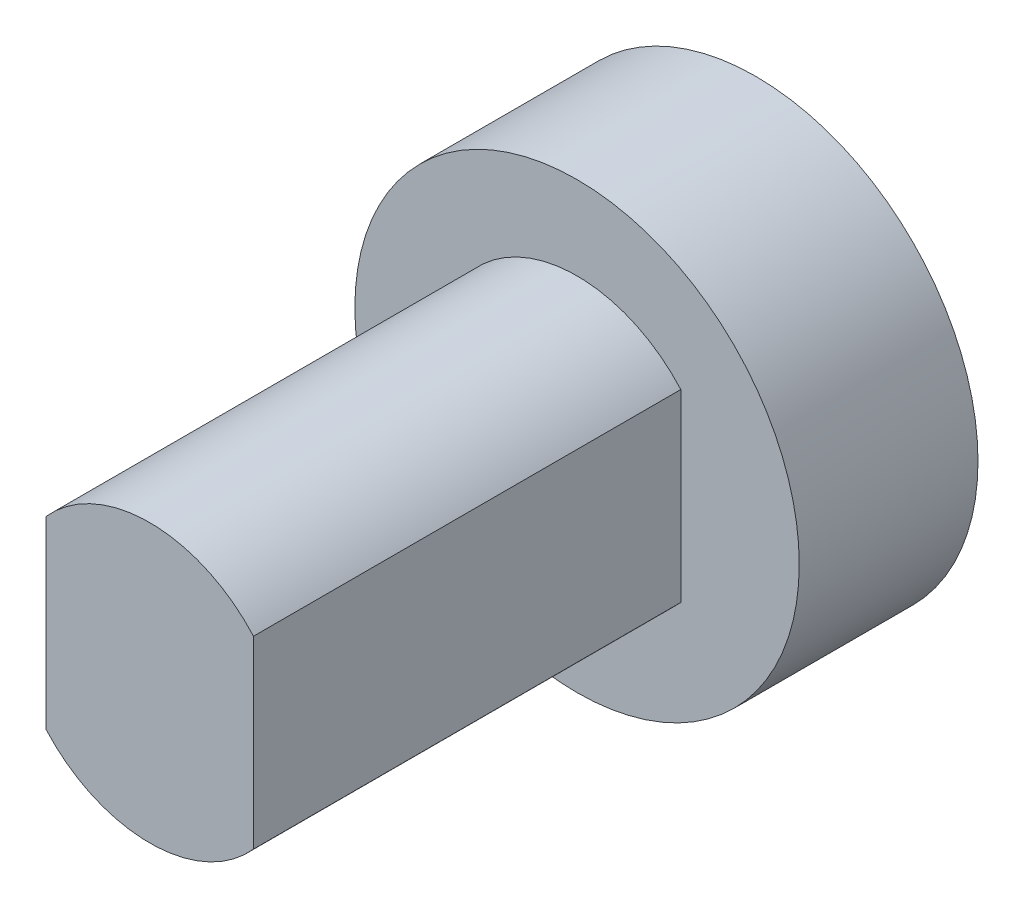
ISO-10303-21;
HEADER;
FILE_DESCRIPTION(('STEP AP214'),'2;1');
FILE_NAME('part.step','',(''),(''),'','','');
FILE_SCHEMA(('AUTOMOTIVE_DESIGN { 1 0 10303 214 1 1 1 1 }'));
ENDSEC;
DATA;
#1=APPLICATION_CONTEXT('core data for automotive mechanical design processes');
#2=APPLICATION_PROTOCOL_DEFINITION('international standard','automotive_design',2000,#1);
#3=PRODUCT_CONTEXT('',#1,'mechanical');
#4=PRODUCT('Part','Part','',(#3));
#5=PRODUCT_RELATED_PRODUCT_CATEGORY('part','',(#4));
#6=PRODUCT_DEFINITION_FORMATION('','',#4);
#7=PRODUCT_DEFINITION_CONTEXT('part definition',#1,'design');
#8=PRODUCT_DEFINITION('design','',#6,#7);
#9=PRODUCT_DEFINITION_SHAPE('','',#8);
#10=(LENGTH_UNIT() NAMED_UNIT(*) SI_UNIT(.MILLI.,.METRE.));
#11=(NAMED_UNIT(*) PLANE_ANGLE_UNIT() SI_UNIT($,.RADIAN.));
#12=(NAMED_UNIT(*) SI_UNIT($,.STERADIAN.) SOLID_ANGLE_UNIT());
#13=UNCERTAINTY_MEASURE_WITH_UNIT(LENGTH_MEASURE(1.E-05),#10,'distance_accuracy_value','');
#14=(GEOMETRIC_REPRESENTATION_CONTEXT(3) GLOBAL_UNCERTAINTY_ASSIGNED_CONTEXT((#13)) GLOBAL_UNIT_ASSIGNED_CONTEXT((#10,
#11,#12)) REPRESENTATION_CONTEXT('',''));
#15=CARTESIAN_POINT('',(0.,0.,0.));
#16=DIRECTION('',(0.,0.,1.));
#17=DIRECTION('',(1.,0.,0.));
#18=AXIS2_PLACEMENT_3D('',#15,#16,#17);
#19=CARTESIAN_POINT('',(0.,-11.0314213562373,0.));
#20=DIRECTION('',(0.,0.,1.));
#21=DIRECTION('',(1.,0.,0.));
#22=AXIS2_PLACEMENT_3D('',#19,#20,#21);
#23=PLANE('',#22);
#24=DIRECTION('',(0.,1.,0.));
#25=VECTOR('',#24,1.);
#26=CARTESIAN_POINT('',(-3.7,-11.0314213562373,0.));
#27=LINE('',#26,#25);
#28=CARTESIAN_POINT('',(-3.7,-3.28823660949147,0.));
#29=VERTEX_POINT('',#28);
#30=CARTESIAN_POINT('',(-3.7,3.28823660949147,0.));
#31=VERTEX_POINT('',#30);
#32=EDGE_CURVE('E58',#29,#31,#27,.T.);
#33=ORIENTED_EDGE('',*,*,#32,.F.);
#34=CARTESIAN_POINT('',(0.,0.,0.));
#35=DIRECTION('',(0.,0.,1.));
#36=DIRECTION('',(1.,0.,0.));
#37=AXIS2_PLACEMENT_3D('',#34,#35,#36);
#38=CIRCLE('',#37,4.95);
#39=CARTESIAN_POINT('',(3.7,-3.28823660949147,0.));
#40=VERTEX_POINT('',#39);
#41=EDGE_CURVE('E71',#40,#29,#38,.F.);
#42=ORIENTED_EDGE('',*,*,#41,.F.);
#43=DIRECTION('',(0.,1.,0.));
#44=VECTOR('',#43,1.);
#45=CARTESIAN_POINT('',(3.7,-11.0314213562373,0.));
#46=LINE('',#45,#44);
#47=CARTESIAN_POINT('',(3.7,3.28823660949147,0.));
#48=VERTEX_POINT('',#47);
#49=EDGE_CURVE('E61',#48,#40,#46,.F.);
#50=ORIENTED_EDGE('',*,*,#49,.F.);
#51=CARTESIAN_POINT('',(0.,0.,0.));
#52=DIRECTION('',(0.,0.,1.));
#53=DIRECTION('',(1.,0.,0.));
#54=AXIS2_PLACEMENT_3D('',#51,#52,#53);
#55=CIRCLE('',#54,4.95);
#56=EDGE_CURVE('E20',#31,#48,#55,.F.);
#57=ORIENTED_EDGE('',*,*,#56,.F.);
#58=EDGE_LOOP('',(#33,#42,#50,#57));
#59=FACE_BOUND('',#58,.T.);
#60=ADVANCED_FACE('F17',(#59),#23,.T.);
#61=CARTESIAN_POINT('',(0.,0.,-15.24));
#62=DIRECTION('',(0.,0.,1.));
#63=DIRECTION('',(1.,0.,0.));
#64=AXIS2_PLACEMENT_3D('',#61,#62,#63);
#65=CYLINDRICAL_SURFACE('',#64,4.95);
#66=CARTESIAN_POINT('',(0.,0.,-15.24));
#67=DIRECTION('',(0.,0.,1.));
#68=DIRECTION('',(1.,0.,0.));
#69=AXIS2_PLACEMENT_3D('',#66,#67,#68);
#70=CIRCLE('',#69,4.95);
#71=CARTESIAN_POINT('',(3.7,3.28823660949147,-15.24));
#72=VERTEX_POINT('',#71);
#73=CARTESIAN_POINT('',(-3.7,3.28823660949147,-15.24));
#74=VERTEX_POINT('',#73);
#75=EDGE_CURVE('E68',#72,#74,#70,.T.);
#76=ORIENTED_EDGE('',*,*,#75,.T.);
#77=DIRECTION('',(0.,0.,1.));
#78=VECTOR('',#77,1.);
#79=CARTESIAN_POINT('',(-3.7,3.28823660949148,-15.24));
#80=LINE('',#79,#78);
#81=EDGE_CURVE('E65',#31,#74,#80,.F.);
#82=ORIENTED_EDGE('',*,*,#81,.F.);
#83=ORIENTED_EDGE('',*,*,#56,.T.);
#84=DIRECTION('',(0.,0.,-1.));
#85=VECTOR('',#84,1.);
#86=CARTESIAN_POINT('',(3.7,3.28823660949147,-15.24));
#87=LINE('',#86,#85);
#88=EDGE_CURVE('E84',#72,#48,#87,.F.);
#89=ORIENTED_EDGE('',*,*,#88,.F.);
#90=EDGE_LOOP('',(#76,#82,#83,#89));
#91=FACE_BOUND('',#90,.T.);
#92=ADVANCED_FACE('F66',(#91),#65,.T.);
#93=CARTESIAN_POINT('',(-3.7,-11.0314213562373,-15.24));
#94=DIRECTION('',(-1.,0.,0.));
#95=DIRECTION('',(0.,0.,1.));
#96=AXIS2_PLACEMENT_3D('',#93,#94,#95);
#97=PLANE('',#96);
#98=DIRECTION('',(0.,1.,0.));
#99=VECTOR('',#98,1.);
#100=CARTESIAN_POINT('',(-3.7,0.,-15.24));
#101=LINE('',#100,#99);
#102=CARTESIAN_POINT('',(-3.7,-3.28823660949147,-15.24));
#103=VERTEX_POINT('',#102);
#104=EDGE_CURVE('E83',#74,#103,#101,.F.);
#105=ORIENTED_EDGE('',*,*,#104,.T.);
#106=DIRECTION('',(0.,0.,1.));
#107=VECTOR('',#106,1.);
#108=CARTESIAN_POINT('',(-3.7,-3.28823660949148,-15.24));
#109=LINE('',#108,#107);
#110=EDGE_CURVE('E74',#29,#103,#109,.F.);
#111=ORIENTED_EDGE('',*,*,#110,.F.);
#112=ORIENTED_EDGE('',*,*,#32,.T.);
#113=ORIENTED_EDGE('',*,*,#81,.T.);
#114=EDGE_LOOP('',(#105,#111,#112,#113));
#115=FACE_BOUND('',#114,.T.);
#116=ADVANCED_FACE('F73',(#115),#97,.T.);
#117=CARTESIAN_POINT('',(0.,0.,-15.24));
#118=DIRECTION('',(0.,0.,1.));
#119=DIRECTION('',(1.,0.,0.));
#120=AXIS2_PLACEMENT_3D('',#117,#118,#119);
#121=CYLINDRICAL_SURFACE('',#120,4.95);
#122=CARTESIAN_POINT('',(0.,0.,-15.24));
#123=DIRECTION('',(0.,0.,1.));
#124=DIRECTION('',(1.,0.,0.));
#125=AXIS2_PLACEMENT_3D('',#122,#123,#124);
#126=CIRCLE('',#125,4.95);
#127=CARTESIAN_POINT('',(3.7,-3.28823660949147,-15.24));
#128=VERTEX_POINT('',#127);
#129=EDGE_CURVE('E35',#103,#128,#126,.T.);
#130=ORIENTED_EDGE('',*,*,#129,.T.);
#131=DIRECTION('',(0.,0.,-1.));
#132=VECTOR('',#131,1.);
#133=CARTESIAN_POINT('',(3.7,-3.28823660949148,-15.24));
#134=LINE('',#133,#132);
#135=EDGE_CURVE('E86',#40,#128,#134,.T.);
#136=ORIENTED_EDGE('',*,*,#135,.F.);
#137=ORIENTED_EDGE('',*,*,#41,.T.);
#138=ORIENTED_EDGE('',*,*,#110,.T.);
#139=EDGE_LOOP('',(#130,#136,#137,#138));
#140=FACE_BOUND('',#139,.T.);
#141=ADVANCED_FACE('F109',(#140),#121,.T.);
#142=CARTESIAN_POINT('',(3.7,-11.0314213562373,-15.24));
#143=DIRECTION('',(1.,0.,0.));
#144=DIRECTION('',(0.,0.,-1.));
#145=AXIS2_PLACEMENT_3D('',#142,#143,#144);
#146=PLANE('',#145);
#147=DIRECTION('',(0.,1.,0.));
#148=VECTOR('',#147,1.);
#149=CARTESIAN_POINT('',(3.7,0.,-15.24));
#150=LINE('',#149,#148);
#151=EDGE_CURVE('E81',#128,#72,#150,.T.);
#152=ORIENTED_EDGE('',*,*,#151,.T.);
#153=ORIENTED_EDGE('',*,*,#88,.T.);
#154=ORIENTED_EDGE('',*,*,#49,.T.);
#155=ORIENTED_EDGE('',*,*,#135,.T.);
#156=EDGE_LOOP('',(#152,#153,#154,#155));
#157=FACE_BOUND('',#156,.T.);
#158=ADVANCED_FACE('F94',(#157),#146,.T.);
#159=CARTESIAN_POINT('',(0.,0.,-15.24));
#160=DIRECTION('',(0.,0.,-1.));
#161=DIRECTION('',(-1.,0.,0.));
#162=AXIS2_PLACEMENT_3D('',#159,#160,#161);
#163=PLANE('',#162);
#164=CARTESIAN_POINT('',(0.,0.,-15.24));
#165=DIRECTION('',(0.,0.,1.));
#166=DIRECTION('',(1.,0.,0.));
#167=AXIS2_PLACEMENT_3D('',#164,#165,#166);
#168=CIRCLE('',#167,7.9248);
#169=CARTESIAN_POINT('',(7.9248,0.,-15.24));
#170=VERTEX_POINT('',#169);
#171=EDGE_CURVE('E26',#170,#170,#168,.F.);
#172=ORIENTED_EDGE('',*,*,#171,.F.);
#173=EDGE_LOOP('',(#172));
#174=FACE_BOUND('',#173,.T.);
#175=ORIENTED_EDGE('',*,*,#129,.F.);
#176=ORIENTED_EDGE('',*,*,#104,.F.);
#177=ORIENTED_EDGE('',*,*,#75,.F.);
#178=ORIENTED_EDGE('',*,*,#151,.F.);
#179=EDGE_LOOP('',(#175,#176,#177,#178));
#180=FACE_BOUND('',#179,.T.);
#181=ADVANCED_FACE('F96',(#174,#180),#163,.F.);
#182=CARTESIAN_POINT('',(0.,0.,-21.6154));
#183=DIRECTION('',(0.,0.,1.));
#184=DIRECTION('',(1.,0.,0.));
#185=AXIS2_PLACEMENT_3D('',#182,#183,#184);
#186=CYLINDRICAL_SURFACE('',#185,7.9248);
#187=ORIENTED_EDGE('',*,*,#171,.T.);
#188=EDGE_LOOP('',(#187));
#189=FACE_BOUND('',#188,.T.);
#190=CARTESIAN_POINT('',(0.,0.,-21.6154));
#191=DIRECTION('',(0.,0.,1.));
#192=DIRECTION('',(1.,0.,0.));
#193=AXIS2_PLACEMENT_3D('',#190,#191,#192);
#194=CIRCLE('',#193,7.9248);
#195=CARTESIAN_POINT('',(7.9248,0.,-21.6154));
#196=VERTEX_POINT('',#195);
#197=EDGE_CURVE('E11',#196,#196,#194,.F.);
#198=ORIENTED_EDGE('',*,*,#197,.F.);
#199=EDGE_LOOP('',(#198));
#200=FACE_BOUND('',#199,.T.);
#201=ADVANCED_FACE('F98',(#189,#200),#186,.T.);
#202=CARTESIAN_POINT('',(0.,0.,-21.6154));
#203=DIRECTION('',(0.,0.,-1.));
#204=DIRECTION('',(-1.,0.,0.));
#205=AXIS2_PLACEMENT_3D('',#202,#203,#204);
#206=PLANE('',#205);
#207=ORIENTED_EDGE('',*,*,#197,.T.);
#208=EDGE_LOOP('',(#207));
#209=FACE_BOUND('',#208,.T.);
#210=ADVANCED_FACE('F106',(#209),#206,.T.);
#211=CLOSED_SHELL('',(#60,#92,#116,#141,#158,#181,#201,#210));
#212=MANIFOLD_SOLID_BREP('B1',#211);
#213=ADVANCED_BREP_SHAPE_REPRESENTATION('',(#18,#212),#14);
#214=SHAPE_DEFINITION_REPRESENTATION(#9,#213);
ENDSEC;
END-ISO-10303-21;
